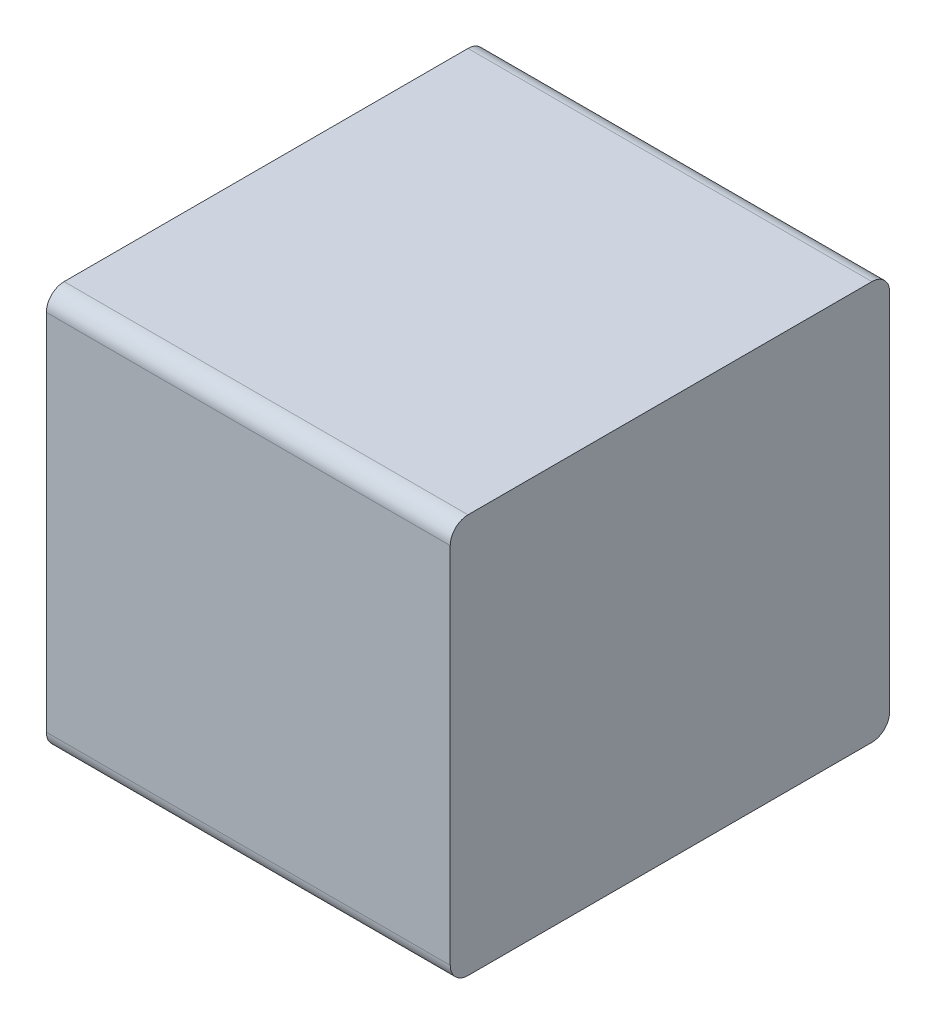
ISO-10303-21;
HEADER;
FILE_DESCRIPTION(('STEP AP214'),'2;1');
FILE_NAME('part.step','',(''),(''),'','','');
FILE_SCHEMA(('AUTOMOTIVE_DESIGN { 1 0 10303 214 1 1 1 1 }'));
ENDSEC;
DATA;
#1=APPLICATION_CONTEXT('core data for automotive mechanical design processes');
#2=APPLICATION_PROTOCOL_DEFINITION('international standard','automotive_design',2000,#1);
#3=PRODUCT_CONTEXT('',#1,'mechanical');
#4=PRODUCT('Part','Part','',(#3));
#5=PRODUCT_RELATED_PRODUCT_CATEGORY('part','',(#4));
#6=PRODUCT_DEFINITION_FORMATION('','',#4);
#7=PRODUCT_DEFINITION_CONTEXT('part definition',#1,'design');
#8=PRODUCT_DEFINITION('design','',#6,#7);
#9=PRODUCT_DEFINITION_SHAPE('','',#8);
#10=(LENGTH_UNIT() NAMED_UNIT(*) SI_UNIT(.MILLI.,.METRE.));
#11=(NAMED_UNIT(*) PLANE_ANGLE_UNIT() SI_UNIT($,.RADIAN.));
#12=(NAMED_UNIT(*) SI_UNIT($,.STERADIAN.) SOLID_ANGLE_UNIT());
#13=UNCERTAINTY_MEASURE_WITH_UNIT(LENGTH_MEASURE(1.E-05),#10,'distance_accuracy_value','');
#14=(GEOMETRIC_REPRESENTATION_CONTEXT(3) GLOBAL_UNCERTAINTY_ASSIGNED_CONTEXT((#13)) GLOBAL_UNIT_ASSIGNED_CONTEXT((#10,
#11,#12)) REPRESENTATION_CONTEXT('',''));
#15=CARTESIAN_POINT('',(0.,0.,0.));
#16=DIRECTION('',(0.,0.,1.));
#17=DIRECTION('',(1.,0.,0.));
#18=AXIS2_PLACEMENT_3D('',#15,#16,#17);
#19=CARTESIAN_POINT('',(-0.25,0.225,0.025));
#20=DIRECTION('',(1.,0.,0.));
#21=DIRECTION('',(0.,0.,-1.));
#22=AXIS2_PLACEMENT_3D('',#19,#20,#21);
#23=CYLINDRICAL_SURFACE('',#22,0.0220000000000001);
#24=CARTESIAN_POINT('',(0.25,0.225,0.025));
#25=DIRECTION('',(1.,0.,0.));
#26=DIRECTION('',(0.,0.,-1.));
#27=AXIS2_PLACEMENT_3D('',#24,#25,#26);
#28=CIRCLE('',#27,0.0220000000000001);
#29=CARTESIAN_POINT('',(0.25,0.225,0.00299999999999994));
#30=VERTEX_POINT('',#29);
#31=CARTESIAN_POINT('',(0.25,0.247,0.025));
#32=VERTEX_POINT('',#31);
#33=EDGE_CURVE('E11',#30,#32,#28,.T.);
#34=ORIENTED_EDGE('',*,*,#33,.F.);
#35=DIRECTION('',(1.,0.,0.));
#36=VECTOR('',#35,1.);
#37=CARTESIAN_POINT('',(-0.25,0.225,0.00299999999999994));
#38=LINE('',#37,#36);
#39=CARTESIAN_POINT('',(-0.25,0.225,0.00299999999999994));
#40=VERTEX_POINT('',#39);
#41=EDGE_CURVE('E24',#40,#30,#38,.T.);
#42=ORIENTED_EDGE('',*,*,#41,.F.);
#43=CARTESIAN_POINT('',(-0.25,0.225,0.025));
#44=DIRECTION('',(-1.,0.,0.));
#45=DIRECTION('',(0.,0.,-1.));
#46=AXIS2_PLACEMENT_3D('',#43,#44,#45);
#47=CIRCLE('',#46,0.0220000000000001);
#48=CARTESIAN_POINT('',(-0.25,0.247,0.025));
#49=VERTEX_POINT('',#48);
#50=EDGE_CURVE('E146',#49,#40,#47,.T.);
#51=ORIENTED_EDGE('',*,*,#50,.F.);
#52=DIRECTION('',(1.,0.,0.));
#53=VECTOR('',#52,1.);
#54=CARTESIAN_POINT('',(-0.25,0.247,0.025));
#55=LINE('',#54,#53);
#56=EDGE_CURVE('E144',#49,#32,#55,.T.);
#57=ORIENTED_EDGE('',*,*,#56,.T.);
#58=EDGE_LOOP('',(#34,#42,#51,#57));
#59=FACE_BOUND('',#58,.T.);
#60=ADVANCED_FACE('F17',(#59),#23,.T.);
#61=CARTESIAN_POINT('',(-0.25,0.225,0.546999999999999));
#62=DIRECTION('',(0.,0.,1.));
#63=DIRECTION('',(0.,-1.,0.));
#64=AXIS2_PLACEMENT_3D('',#61,#62,#63);
#65=PLANE('',#64);
#66=DIRECTION('',(0.,-1.,0.));
#67=VECTOR('',#66,1.);
#68=CARTESIAN_POINT('',(0.25,0.2375,0.546999999999999));
#69=LINE('',#68,#67);
#70=CARTESIAN_POINT('',(0.25,0.225,0.546999999999999));
#71=VERTEX_POINT('',#70);
#72=CARTESIAN_POINT('',(0.25,-0.225,0.546999999999999));
#73=VERTEX_POINT('',#72);
#74=EDGE_CURVE('E142',#71,#73,#69,.T.);
#75=ORIENTED_EDGE('',*,*,#74,.F.);
#76=DIRECTION('',(1.,0.,0.));
#77=VECTOR('',#76,1.);
#78=CARTESIAN_POINT('',(-0.25,0.225,0.546999999999999));
#79=LINE('',#78,#77);
#80=CARTESIAN_POINT('',(-0.25,0.225,0.546999999999999));
#81=VERTEX_POINT('',#80);
#82=EDGE_CURVE('E139',#81,#71,#79,.T.);
#83=ORIENTED_EDGE('',*,*,#82,.F.);
#84=DIRECTION('',(0.,1.,0.));
#85=VECTOR('',#84,1.);
#86=CARTESIAN_POINT('',(-0.25,-0.0125,0.546999999999999));
#87=LINE('',#86,#85);
#88=CARTESIAN_POINT('',(-0.25,-0.225,0.546999999999999));
#89=VERTEX_POINT('',#88);
#90=EDGE_CURVE('E137',#89,#81,#87,.T.);
#91=ORIENTED_EDGE('',*,*,#90,.F.);
#92=DIRECTION('',(1.,0.,0.));
#93=VECTOR('',#92,1.);
#94=CARTESIAN_POINT('',(-0.25,-0.225,0.546999999999999));
#95=LINE('',#94,#93);
#96=EDGE_CURVE('E104',#89,#73,#95,.T.);
#97=ORIENTED_EDGE('',*,*,#96,.T.);
#98=EDGE_LOOP('',(#75,#83,#91,#97));
#99=FACE_BOUND('',#98,.T.);
#100=ADVANCED_FACE('F163',(#99),#65,.T.);
#101=CARTESIAN_POINT('',(-0.25,0.247,0.025));
#102=DIRECTION('',(0.,1.,0.));
#103=DIRECTION('',(0.,0.,1.));
#104=AXIS2_PLACEMENT_3D('',#101,#102,#103);
#105=PLANE('',#104);
#106=DIRECTION('',(0.,0.,1.));
#107=VECTOR('',#106,1.);
#108=CARTESIAN_POINT('',(0.25,0.247,0.0125));
#109=LINE('',#108,#107);
#110=CARTESIAN_POINT('',(0.25,0.247,0.525000000000001));
#111=VERTEX_POINT('',#110);
#112=EDGE_CURVE('E134',#32,#111,#109,.T.);
#113=ORIENTED_EDGE('',*,*,#112,.F.);
#114=ORIENTED_EDGE('',*,*,#56,.F.);
#115=DIRECTION('',(0.,0.,-1.));
#116=VECTOR('',#115,1.);
#117=CARTESIAN_POINT('',(-0.25,0.247,0.0125));
#118=LINE('',#117,#116);
#119=CARTESIAN_POINT('',(-0.25,0.247,0.525000000000001));
#120=VERTEX_POINT('',#119);
#121=EDGE_CURVE('E131',#120,#49,#118,.T.);
#122=ORIENTED_EDGE('',*,*,#121,.F.);
#123=DIRECTION('',(1.,0.,0.));
#124=VECTOR('',#123,1.);
#125=CARTESIAN_POINT('',(-0.25,0.247,0.525000000000001));
#126=LINE('',#125,#124);
#127=EDGE_CURVE('E128',#120,#111,#126,.T.);
#128=ORIENTED_EDGE('',*,*,#127,.T.);
#129=EDGE_LOOP('',(#113,#114,#122,#128));
#130=FACE_BOUND('',#129,.T.);
#131=ADVANCED_FACE('F156',(#130),#105,.T.);
#132=CARTESIAN_POINT('',(-0.25,0.225,0.525000000000001));
#133=DIRECTION('',(1.,0.,0.));
#134=DIRECTION('',(0.,1.,0.));
#135=AXIS2_PLACEMENT_3D('',#132,#133,#134);
#136=CYLINDRICAL_SURFACE('',#135,0.0220000000000001);
#137=CARTESIAN_POINT('',(0.25,0.225,0.525000000000001));
#138=DIRECTION('',(1.,0.,0.));
#139=DIRECTION('',(0.,1.,0.));
#140=AXIS2_PLACEMENT_3D('',#137,#138,#139);
#141=CIRCLE('',#140,0.0220000000000001);
#142=EDGE_CURVE('E125',#111,#71,#141,.T.);
#143=ORIENTED_EDGE('',*,*,#142,.F.);
#144=ORIENTED_EDGE('',*,*,#127,.F.);
#145=CARTESIAN_POINT('',(-0.25,0.225,0.525000000000001));
#146=DIRECTION('',(-1.,0.,0.));
#147=DIRECTION('',(0.,1.,0.));
#148=AXIS2_PLACEMENT_3D('',#145,#146,#147);
#149=CIRCLE('',#148,0.0220000000000001);
#150=EDGE_CURVE('E122',#81,#120,#149,.T.);
#151=ORIENTED_EDGE('',*,*,#150,.F.);
#152=ORIENTED_EDGE('',*,*,#82,.T.);
#153=EDGE_LOOP('',(#143,#144,#151,#152));
#154=FACE_BOUND('',#153,.T.);
#155=ADVANCED_FACE('F160',(#154),#136,.T.);
#156=CARTESIAN_POINT('',(-0.25,-0.225,0.00299999999999994));
#157=DIRECTION('',(0.,0.,-1.));
#158=DIRECTION('',(0.,1.,0.));
#159=AXIS2_PLACEMENT_3D('',#156,#157,#158);
#160=PLANE('',#159);
#161=DIRECTION('',(0.,1.,0.));
#162=VECTOR('',#161,1.);
#163=CARTESIAN_POINT('',(0.25,0.0125,0.00299999999999994));
#164=LINE('',#163,#162);
#165=CARTESIAN_POINT('',(0.25,-0.225,0.00299999999999994));
#166=VERTEX_POINT('',#165);
#167=EDGE_CURVE('E120',#166,#30,#164,.T.);
#168=ORIENTED_EDGE('',*,*,#167,.F.);
#169=DIRECTION('',(1.,0.,0.));
#170=VECTOR('',#169,1.);
#171=CARTESIAN_POINT('',(-0.25,-0.225,0.00299999999999994));
#172=LINE('',#171,#170);
#173=CARTESIAN_POINT('',(-0.25,-0.225,0.00299999999999994));
#174=VERTEX_POINT('',#173);
#175=EDGE_CURVE('E117',#174,#166,#172,.T.);
#176=ORIENTED_EDGE('',*,*,#175,.F.);
#177=DIRECTION('',(0.,-1.,0.));
#178=VECTOR('',#177,1.);
#179=CARTESIAN_POINT('',(-0.25,-0.2375,0.00299999999999994));
#180=LINE('',#179,#178);
#181=EDGE_CURVE('E115',#40,#174,#180,.T.);
#182=ORIENTED_EDGE('',*,*,#181,.F.);
#183=ORIENTED_EDGE('',*,*,#41,.T.);
#184=EDGE_LOOP('',(#168,#176,#182,#183));
#185=FACE_BOUND('',#184,.T.);
#186=ADVANCED_FACE('F149',(#185),#160,.T.);
#187=CARTESIAN_POINT('',(-0.25,-0.225,0.025));
#188=DIRECTION('',(1.,0.,0.));
#189=DIRECTION('',(0.,-1.,1.0583208867346E-09));
#190=AXIS2_PLACEMENT_3D('',#187,#188,#189);
#191=CYLINDRICAL_SURFACE('',#190,0.0220000000000001);
#192=CARTESIAN_POINT('',(0.25,-0.225,0.025));
#193=DIRECTION('',(1.,0.,0.));
#194=DIRECTION('',(0.,-1.,1.0583208867346E-09));
#195=AXIS2_PLACEMENT_3D('',#192,#193,#194);
#196=CIRCLE('',#195,0.0220000000000001);
#197=CARTESIAN_POINT('',(0.25,-0.247,0.0250000000232831));
#198=VERTEX_POINT('',#197);
#199=EDGE_CURVE('E112',#198,#166,#196,.T.);
#200=ORIENTED_EDGE('',*,*,#199,.F.);
#201=DIRECTION('',(1.,0.,0.));
#202=VECTOR('',#201,1.);
#203=CARTESIAN_POINT('',(-0.25,-0.247,0.0250000000232831));
#204=LINE('',#203,#202);
#205=CARTESIAN_POINT('',(-0.25,-0.247,0.0250000000232831));
#206=VERTEX_POINT('',#205);
#207=EDGE_CURVE('E110',#206,#198,#204,.T.);
#208=ORIENTED_EDGE('',*,*,#207,.F.);
#209=CARTESIAN_POINT('',(-0.25,-0.225,0.025));
#210=DIRECTION('',(-1.,0.,0.));
#211=DIRECTION('',(0.,-1.,1.0583208867346E-09));
#212=AXIS2_PLACEMENT_3D('',#209,#210,#211);
#213=CIRCLE('',#212,0.0220000000000001);
#214=EDGE_CURVE('E98',#174,#206,#213,.T.);
#215=ORIENTED_EDGE('',*,*,#214,.F.);
#216=ORIENTED_EDGE('',*,*,#175,.T.);
#217=EDGE_LOOP('',(#200,#208,#215,#216));
#218=FACE_BOUND('',#217,.T.);
#219=ADVANCED_FACE('F152',(#218),#191,.T.);
#220=CARTESIAN_POINT('',(-0.25,-0.247000000000001,0.525000000000001));
#221=DIRECTION('',(0.,-1.,0.));
#222=DIRECTION('',(0.,0.,-1.));
#223=AXIS2_PLACEMENT_3D('',#220,#221,#222);
#224=PLANE('',#223);
#225=DIRECTION('',(0.,0.,-1.));
#226=VECTOR('',#225,1.);
#227=CARTESIAN_POINT('',(0.25,-0.247000000000001,0.262499999999999));
#228=LINE('',#227,#226);
#229=CARTESIAN_POINT('',(0.25,-0.247000000000001,0.525000000000001));
#230=VERTEX_POINT('',#229);
#231=EDGE_CURVE('E83',#230,#198,#228,.T.);
#232=ORIENTED_EDGE('',*,*,#231,.F.);
#233=DIRECTION('',(1.,0.,0.));
#234=VECTOR('',#233,1.);
#235=CARTESIAN_POINT('',(-0.25,-0.247000000000001,0.525000000000001));
#236=LINE('',#235,#234);
#237=CARTESIAN_POINT('',(-0.25,-0.247000000000001,0.525000000000001));
#238=VERTEX_POINT('',#237);
#239=EDGE_CURVE('E77',#238,#230,#236,.T.);
#240=ORIENTED_EDGE('',*,*,#239,.F.);
#241=DIRECTION('',(0.,0.,1.));
#242=VECTOR('',#241,1.);
#243=CARTESIAN_POINT('',(-0.25,-0.247000000000001,0.262499999999999));
#244=LINE('',#243,#242);
#245=EDGE_CURVE('E81',#206,#238,#244,.T.);
#246=ORIENTED_EDGE('',*,*,#245,.F.);
#247=ORIENTED_EDGE('',*,*,#207,.T.);
#248=EDGE_LOOP('',(#232,#240,#246,#247));
#249=FACE_BOUND('',#248,.T.);
#250=ADVANCED_FACE('F79',(#249),#224,.T.);
#251=CARTESIAN_POINT('',(-0.25,-0.225,0.525000000000001));
#252=DIRECTION('',(1.,0.,0.));
#253=DIRECTION('',(0.,0.,1.));
#254=AXIS2_PLACEMENT_3D('',#251,#252,#253);
#255=CYLINDRICAL_SURFACE('',#254,0.0220000000000001);
#256=CARTESIAN_POINT('',(0.25,-0.225,0.525000000000001));
#257=DIRECTION('',(1.,0.,0.));
#258=DIRECTION('',(0.,0.,1.));
#259=AXIS2_PLACEMENT_3D('',#256,#257,#258);
#260=CIRCLE('',#259,0.0220000000000001);
#261=EDGE_CURVE('E99',#73,#230,#260,.T.);
#262=ORIENTED_EDGE('',*,*,#261,.F.);
#263=ORIENTED_EDGE('',*,*,#96,.F.);
#264=CARTESIAN_POINT('',(-0.25,-0.225,0.525000000000001));
#265=DIRECTION('',(-1.,0.,0.));
#266=DIRECTION('',(0.,0.,1.));
#267=AXIS2_PLACEMENT_3D('',#264,#265,#266);
#268=CIRCLE('',#267,0.0220000000000001);
#269=EDGE_CURVE('E95',#238,#89,#268,.T.);
#270=ORIENTED_EDGE('',*,*,#269,.F.);
#271=ORIENTED_EDGE('',*,*,#239,.T.);
#272=EDGE_LOOP('',(#262,#263,#270,#271));
#273=FACE_BOUND('',#272,.T.);
#274=ADVANCED_FACE('F102',(#273),#255,.T.);
#275=CARTESIAN_POINT('',(-0.25,-0.25,0.));
#276=DIRECTION('',(1.,0.,0.));
#277=DIRECTION('',(0.,1.,0.));
#278=AXIS2_PLACEMENT_3D('',#275,#276,#277);
#279=PLANE('',#278);
#280=ORIENTED_EDGE('',*,*,#50,.T.);
#281=ORIENTED_EDGE('',*,*,#181,.T.);
#282=ORIENTED_EDGE('',*,*,#214,.T.);
#283=ORIENTED_EDGE('',*,*,#245,.T.);
#284=ORIENTED_EDGE('',*,*,#269,.T.);
#285=ORIENTED_EDGE('',*,*,#90,.T.);
#286=ORIENTED_EDGE('',*,*,#150,.T.);
#287=ORIENTED_EDGE('',*,*,#121,.T.);
#288=EDGE_LOOP('',(#280,#281,#282,#283,#284,#285,#286,#287));
#289=FACE_BOUND('',#288,.T.);
#290=ADVANCED_FACE('F93',(#289),#279,.F.);
#291=CARTESIAN_POINT('',(0.25,0.25,0.));
#292=DIRECTION('',(-1.,0.,0.));
#293=DIRECTION('',(0.,-1.,0.));
#294=AXIS2_PLACEMENT_3D('',#291,#292,#293);
#295=PLANE('',#294);
#296=ORIENTED_EDGE('',*,*,#33,.T.);
#297=ORIENTED_EDGE('',*,*,#112,.T.);
#298=ORIENTED_EDGE('',*,*,#142,.T.);
#299=ORIENTED_EDGE('',*,*,#74,.T.);
#300=ORIENTED_EDGE('',*,*,#261,.T.);
#301=ORIENTED_EDGE('',*,*,#231,.T.);
#302=ORIENTED_EDGE('',*,*,#199,.T.);
#303=ORIENTED_EDGE('',*,*,#167,.T.);
#304=EDGE_LOOP('',(#296,#297,#298,#299,#300,#301,#302,#303));
#305=FACE_BOUND('',#304,.T.);
#306=ADVANCED_FACE('F150',(#305),#295,.F.);
#307=CLOSED_SHELL('',(#60,#100,#131,#155,#186,#219,#250,#274,#290,#306));
#308=MANIFOLD_SOLID_BREP('B1',#307);
#309=ADVANCED_BREP_SHAPE_REPRESENTATION('',(#18,#308),#14);
#310=SHAPE_DEFINITION_REPRESENTATION(#9,#309);
ENDSEC;
END-ISO-10303-21;
